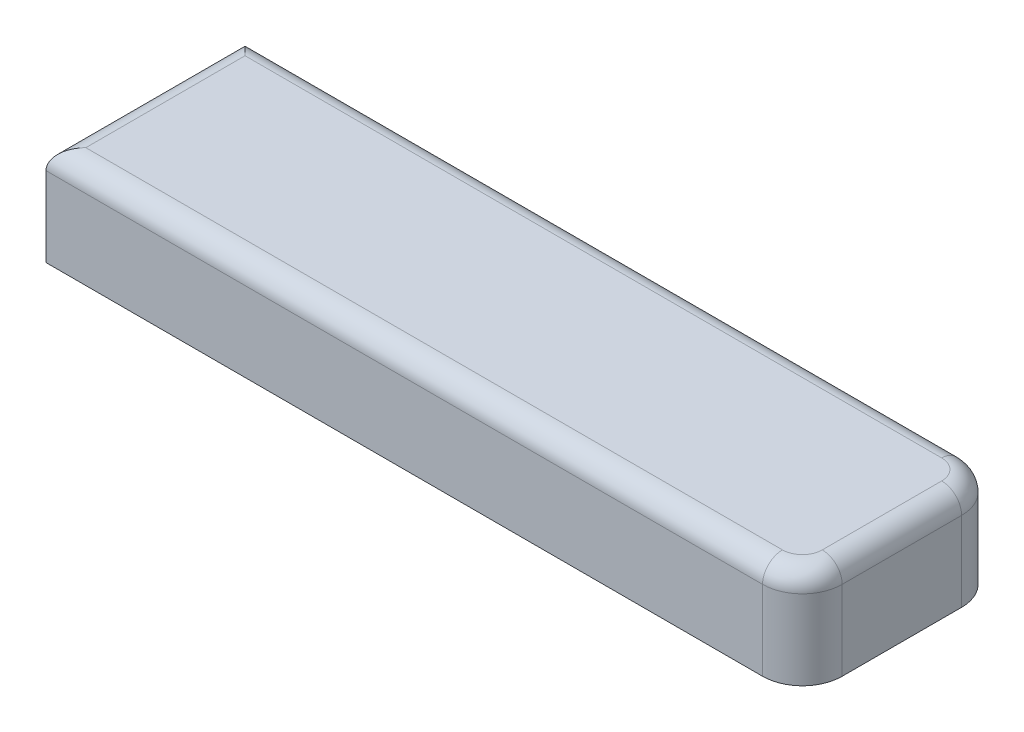
ISO-10303-21;
HEADER;
FILE_DESCRIPTION(('STEP AP214'),'2;1');
FILE_NAME('part.step','',(''),(''),'','','');
FILE_SCHEMA(('AUTOMOTIVE_DESIGN { 1 0 10303 214 1 1 1 1 }'));
ENDSEC;
DATA;
#1=APPLICATION_CONTEXT('core data for automotive mechanical design processes');
#2=APPLICATION_PROTOCOL_DEFINITION('international standard','automotive_design',2000,#1);
#3=PRODUCT_CONTEXT('',#1,'mechanical');
#4=PRODUCT('Part','Part','',(#3));
#5=PRODUCT_RELATED_PRODUCT_CATEGORY('part','',(#4));
#6=PRODUCT_DEFINITION_FORMATION('','',#4);
#7=PRODUCT_DEFINITION_CONTEXT('part definition',#1,'design');
#8=PRODUCT_DEFINITION('design','',#6,#7);
#9=PRODUCT_DEFINITION_SHAPE('','',#8);
#10=(LENGTH_UNIT() NAMED_UNIT(*) SI_UNIT(.MILLI.,.METRE.));
#11=(NAMED_UNIT(*) PLANE_ANGLE_UNIT() SI_UNIT($,.RADIAN.));
#12=(NAMED_UNIT(*) SI_UNIT($,.STERADIAN.) SOLID_ANGLE_UNIT());
#13=UNCERTAINTY_MEASURE_WITH_UNIT(LENGTH_MEASURE(1.E-05),#10,'distance_accuracy_value','');
#14=(GEOMETRIC_REPRESENTATION_CONTEXT(3) GLOBAL_UNCERTAINTY_ASSIGNED_CONTEXT((#13)) GLOBAL_UNIT_ASSIGNED_CONTEXT((#10,
#11,#12)) REPRESENTATION_CONTEXT('',''));
#15=CARTESIAN_POINT('',(0.,0.,0.));
#16=DIRECTION('',(0.,0.,1.));
#17=DIRECTION('',(1.,0.,0.));
#18=AXIS2_PLACEMENT_3D('',#15,#16,#17);
#19=CARTESIAN_POINT('',(0.,0.,10.));
#20=DIRECTION('',(0.,-1.,0.));
#21=DIRECTION('',(0.,0.,-1.));
#22=AXIS2_PLACEMENT_3D('',#19,#20,#21);
#23=PLANE('',#22);
#24=CARTESIAN_POINT('',(36.,0.,8.));
#25=DIRECTION('',(0.,-1.,0.));
#26=DIRECTION('',(0.,0.,-1.));
#27=AXIS2_PLACEMENT_3D('',#24,#25,#26);
#28=CIRCLE('',#27,1.);
#29=CARTESIAN_POINT('',(37.,0.,8.));
#30=VERTEX_POINT('',#29);
#31=CARTESIAN_POINT('',(36.,0.,9.));
#32=VERTEX_POINT('',#31);
#33=EDGE_CURVE('E169',#30,#32,#28,.T.);
#34=ORIENTED_EDGE('',*,*,#33,.F.);
#35=DIRECTION('',(0.,0.,-1.));
#36=VECTOR('',#35,1.);
#37=CARTESIAN_POINT('',(37.,0.,10.));
#38=LINE('',#37,#36);
#39=CARTESIAN_POINT('',(37.,0.,2.));
#40=VERTEX_POINT('',#39);
#41=EDGE_CURVE('E145',#30,#40,#38,.T.);
#42=ORIENTED_EDGE('',*,*,#41,.T.);
#43=CARTESIAN_POINT('',(36.,0.,2.));
#44=DIRECTION('',(0.,-1.,0.));
#45=DIRECTION('',(0.,0.,-1.));
#46=AXIS2_PLACEMENT_3D('',#43,#44,#45);
#47=CIRCLE('',#46,1.);
#48=CARTESIAN_POINT('',(36.,0.,0.999999999999999));
#49=VERTEX_POINT('',#48);
#50=EDGE_CURVE('E166',#49,#40,#47,.T.);
#51=ORIENTED_EDGE('',*,*,#50,.F.);
#52=DIRECTION('',(-1.,0.,0.));
#53=VECTOR('',#52,1.);
#54=CARTESIAN_POINT('',(0.,0.,0.999999999999999));
#55=LINE('',#54,#53);
#56=CARTESIAN_POINT('',(1.,0.,0.999999999999999));
#57=VERTEX_POINT('',#56);
#58=EDGE_CURVE('E133',#49,#57,#55,.T.);
#59=ORIENTED_EDGE('',*,*,#58,.T.);
#60=DIRECTION('',(0.,0.,-1.));
#61=VECTOR('',#60,1.);
#62=CARTESIAN_POINT('',(1.,0.,10.));
#63=LINE('',#62,#61);
#64=CARTESIAN_POINT('',(1.,0.,9.));
#65=VERTEX_POINT('',#64);
#66=EDGE_CURVE('E135',#57,#65,#63,.F.);
#67=ORIENTED_EDGE('',*,*,#66,.T.);
#68=DIRECTION('',(-1.,0.,0.));
#69=VECTOR('',#68,1.);
#70=CARTESIAN_POINT('',(38.,0.,9.));
#71=LINE('',#70,#69);
#72=EDGE_CURVE('E142',#65,#32,#71,.F.);
#73=ORIENTED_EDGE('',*,*,#72,.T.);
#74=EDGE_LOOP('',(#34,#42,#51,#59,#67,#73));
#75=FACE_BOUND('',#74,.T.);
#76=ADVANCED_FACE('F39',(#75),#23,.F.);
#77=CARTESIAN_POINT('',(0.,0.,10.));
#78=DIRECTION('',(1.,0.,0.));
#79=DIRECTION('',(0.,1.,0.));
#80=AXIS2_PLACEMENT_3D('',#77,#78,#79);
#81=PLANE('',#80);
#82=DIRECTION('',(0.,-1.,0.));
#83=VECTOR('',#82,1.);
#84=CARTESIAN_POINT('',(0.,0.,10.));
#85=LINE('',#84,#83);
#86=CARTESIAN_POINT('',(0.,-1.,10.));
#87=VERTEX_POINT('',#86);
#88=CARTESIAN_POINT('',(0.,-5.,10.));
#89=VERTEX_POINT('',#88);
#90=EDGE_CURVE('E114',#87,#89,#85,.T.);
#91=ORIENTED_EDGE('',*,*,#90,.F.);
#92=DIRECTION('',(0.,0.,-1.));
#93=VECTOR('',#92,1.);
#94=CARTESIAN_POINT('',(0.,-1.,10.));
#95=LINE('',#94,#93);
#96=CARTESIAN_POINT('',(0.,-1.,0.));
#97=VERTEX_POINT('',#96);
#98=EDGE_CURVE('E152',#87,#97,#95,.T.);
#99=ORIENTED_EDGE('',*,*,#98,.T.);
#100=DIRECTION('',(0.,-1.,0.));
#101=VECTOR('',#100,1.);
#102=CARTESIAN_POINT('',(0.,0.,0.));
#103=LINE('',#102,#101);
#104=CARTESIAN_POINT('',(0.,-5.,0.));
#105=VERTEX_POINT('',#104);
#106=EDGE_CURVE('E132',#97,#105,#103,.T.);
#107=ORIENTED_EDGE('',*,*,#106,.T.);
#108=DIRECTION('',(0.,0.,-1.));
#109=VECTOR('',#108,1.);
#110=CARTESIAN_POINT('',(0.,-5.,10.));
#111=LINE('',#110,#109);
#112=EDGE_CURVE('E127',#89,#105,#111,.T.);
#113=ORIENTED_EDGE('',*,*,#112,.F.);
#114=EDGE_LOOP('',(#91,#99,#107,#113));
#115=FACE_BOUND('',#114,.T.);
#116=ADVANCED_FACE('F130',(#115),#81,.F.);
#117=CARTESIAN_POINT('',(0.,-5.,10.));
#118=DIRECTION('',(0.,1.,0.));
#119=DIRECTION('',(-1.,0.,0.));
#120=AXIS2_PLACEMENT_3D('',#117,#118,#119);
#121=PLANE('',#120);
#122=DIRECTION('',(1.,0.,0.));
#123=VECTOR('',#122,1.);
#124=CARTESIAN_POINT('',(0.,-5.,0.));
#125=LINE('',#124,#123);
#126=CARTESIAN_POINT('',(36.,-5.,0.));
#127=VERTEX_POINT('',#126);
#128=EDGE_CURVE('E123',#105,#127,#125,.T.);
#129=ORIENTED_EDGE('',*,*,#128,.T.);
#130=CARTESIAN_POINT('',(36.,-5.,2.));
#131=DIRECTION('',(0.,1.,0.));
#132=DIRECTION('',(-1.,0.,0.));
#133=AXIS2_PLACEMENT_3D('',#130,#131,#132);
#134=CIRCLE('',#133,2.);
#135=CARTESIAN_POINT('',(38.,-5.,2.));
#136=VERTEX_POINT('',#135);
#137=EDGE_CURVE('E48',#127,#136,#134,.F.);
#138=ORIENTED_EDGE('',*,*,#137,.T.);
#139=DIRECTION('',(0.,0.,-1.));
#140=VECTOR('',#139,1.);
#141=CARTESIAN_POINT('',(38.,-5.,10.));
#142=LINE('',#141,#140);
#143=CARTESIAN_POINT('',(38.,-5.,8.));
#144=VERTEX_POINT('',#143);
#145=EDGE_CURVE('E128',#144,#136,#142,.T.);
#146=ORIENTED_EDGE('',*,*,#145,.F.);
#147=CARTESIAN_POINT('',(36.,-5.,8.));
#148=DIRECTION('',(0.,1.,0.));
#149=DIRECTION('',(-1.,0.,0.));
#150=AXIS2_PLACEMENT_3D('',#147,#148,#149);
#151=CIRCLE('',#150,2.);
#152=CARTESIAN_POINT('',(36.,-5.,10.));
#153=VERTEX_POINT('',#152);
#154=EDGE_CURVE('E56',#144,#153,#151,.F.);
#155=ORIENTED_EDGE('',*,*,#154,.T.);
#156=DIRECTION('',(1.,0.,0.));
#157=VECTOR('',#156,1.);
#158=CARTESIAN_POINT('',(0.,-5.,10.));
#159=LINE('',#158,#157);
#160=EDGE_CURVE('E116',#89,#153,#159,.T.);
#161=ORIENTED_EDGE('',*,*,#160,.F.);
#162=ORIENTED_EDGE('',*,*,#112,.T.);
#163=EDGE_LOOP('',(#129,#138,#146,#155,#161,#162));
#164=FACE_BOUND('',#163,.T.);
#165=ADVANCED_FACE('F126',(#164),#121,.F.);
#166=CARTESIAN_POINT('',(38.,0.,10.));
#167=DIRECTION('',(-1.,0.,0.));
#168=DIRECTION('',(0.,0.,1.));
#169=AXIS2_PLACEMENT_3D('',#166,#167,#168);
#170=PLANE('',#169);
#171=ORIENTED_EDGE('',*,*,#145,.T.);
#172=DIRECTION('',(0.,1.,0.));
#173=VECTOR('',#172,1.);
#174=CARTESIAN_POINT('',(38.,0.,2.));
#175=LINE('',#174,#173);
#176=CARTESIAN_POINT('',(38.,-1.,2.));
#177=VERTEX_POINT('',#176);
#178=EDGE_CURVE('E179',#136,#177,#175,.T.);
#179=ORIENTED_EDGE('',*,*,#178,.T.);
#180=DIRECTION('',(0.,0.,-1.));
#181=VECTOR('',#180,1.);
#182=CARTESIAN_POINT('',(38.,-1.,10.));
#183=LINE('',#182,#181);
#184=CARTESIAN_POINT('',(38.,-1.,8.));
#185=VERTEX_POINT('',#184);
#186=EDGE_CURVE('E148',#177,#185,#183,.F.);
#187=ORIENTED_EDGE('',*,*,#186,.T.);
#188=DIRECTION('',(0.,1.,0.));
#189=VECTOR('',#188,1.);
#190=CARTESIAN_POINT('',(38.,-5.,8.));
#191=LINE('',#190,#189);
#192=EDGE_CURVE('E177',#185,#144,#191,.F.);
#193=ORIENTED_EDGE('',*,*,#192,.T.);
#194=EDGE_LOOP('',(#171,#179,#187,#193));
#195=FACE_BOUND('',#194,.T.);
#196=ADVANCED_FACE('F198',(#195),#170,.F.);
#197=CARTESIAN_POINT('',(0.,0.,10.));
#198=DIRECTION('',(0.,0.,1.));
#199=DIRECTION('',(1.,0.,0.));
#200=AXIS2_PLACEMENT_3D('',#197,#198,#199);
#201=PLANE('',#200);
#202=ORIENTED_EDGE('',*,*,#160,.T.);
#203=DIRECTION('',(0.,1.,0.));
#204=VECTOR('',#203,1.);
#205=CARTESIAN_POINT('',(36.,-1.,10.));
#206=LINE('',#205,#204);
#207=CARTESIAN_POINT('',(36.,-1.,10.));
#208=VERTEX_POINT('',#207);
#209=EDGE_CURVE('E11',#153,#208,#206,.T.);
#210=ORIENTED_EDGE('',*,*,#209,.T.);
#211=DIRECTION('',(-1.,0.,0.));
#212=VECTOR('',#211,1.);
#213=CARTESIAN_POINT('',(0.,-1.,10.));
#214=LINE('',#213,#212);
#215=EDGE_CURVE('E119',#208,#87,#214,.T.);
#216=ORIENTED_EDGE('',*,*,#215,.T.);
#217=ORIENTED_EDGE('',*,*,#90,.T.);
#218=EDGE_LOOP('',(#202,#210,#216,#217));
#219=FACE_BOUND('',#218,.T.);
#220=ADVANCED_FACE('F115',(#219),#201,.T.);
#221=CARTESIAN_POINT('',(0.,0.,0.));
#222=DIRECTION('',(0.,0.,1.));
#223=DIRECTION('',(1.,0.,0.));
#224=AXIS2_PLACEMENT_3D('',#221,#222,#223);
#225=PLANE('',#224);
#226=DIRECTION('',(-1.,0.,0.));
#227=VECTOR('',#226,1.);
#228=CARTESIAN_POINT('',(0.,-1.,0.));
#229=LINE('',#228,#227);
#230=CARTESIAN_POINT('',(36.,-1.,0.));
#231=VERTEX_POINT('',#230);
#232=EDGE_CURVE('E154',#97,#231,#229,.F.);
#233=ORIENTED_EDGE('',*,*,#232,.T.);
#234=DIRECTION('',(0.,1.,0.));
#235=VECTOR('',#234,1.);
#236=CARTESIAN_POINT('',(36.,0.,0.));
#237=LINE('',#236,#235);
#238=EDGE_CURVE('E64',#231,#127,#237,.F.);
#239=ORIENTED_EDGE('',*,*,#238,.T.);
#240=ORIENTED_EDGE('',*,*,#128,.F.);
#241=ORIENTED_EDGE('',*,*,#106,.F.);
#242=EDGE_LOOP('',(#233,#239,#240,#241));
#243=FACE_BOUND('',#242,.T.);
#244=ADVANCED_FACE('F212',(#243),#225,.F.);
#245=CARTESIAN_POINT('',(1.,-1.,10.));
#246=DIRECTION('',(0.,0.,-1.));
#247=DIRECTION('',(-1.,0.,0.));
#248=AXIS2_PLACEMENT_3D('',#245,#246,#247);
#249=CYLINDRICAL_SURFACE('',#248,1.);
#250=CARTESIAN_POINT('',(1.,-1.,0.999999999999999));
#251=DIRECTION('',(-0.707106781186547,0.,0.707106781186547));
#252=DIRECTION('',(-0.707106781186547,0.,-0.707106781186547));
#253=AXIS2_PLACEMENT_3D('',#250,#251,#252);
#254=ELLIPSE('',#253,1.41421356237309,1.);
#255=EDGE_CURVE('E157',#97,#57,#254,.F.);
#256=ORIENTED_EDGE('',*,*,#255,.F.);
#257=ORIENTED_EDGE('',*,*,#98,.F.);
#258=CARTESIAN_POINT('',(1.,-1.,9.));
#259=DIRECTION('',(-0.707106781186547,0.,-0.707106781186547));
#260=DIRECTION('',(0.707106781186547,0.,-0.707106781186547));
#261=AXIS2_PLACEMENT_3D('',#258,#259,#260);
#262=ELLIPSE('',#261,1.41421356237309,1.);
#263=EDGE_CURVE('E160',#65,#87,#262,.F.);
#264=ORIENTED_EDGE('',*,*,#263,.F.);
#265=ORIENTED_EDGE('',*,*,#66,.F.);
#266=EDGE_LOOP('',(#256,#257,#264,#265));
#267=FACE_BOUND('',#266,.T.);
#268=ADVANCED_FACE('F210',(#267),#249,.T.);
#269=CARTESIAN_POINT('',(0.,-1.,9.));
#270=DIRECTION('',(1.,0.,0.));
#271=DIRECTION('',(0.,0.,-1.));
#272=AXIS2_PLACEMENT_3D('',#269,#270,#271);
#273=CYLINDRICAL_SURFACE('',#272,1.);
#274=ORIENTED_EDGE('',*,*,#215,.F.);
#275=CARTESIAN_POINT('',(36.,-1.,9.));
#276=DIRECTION('',(-1.,0.,0.));
#277=DIRECTION('',(0.,0.,1.));
#278=AXIS2_PLACEMENT_3D('',#275,#276,#277);
#279=CIRCLE('',#278,1.);
#280=EDGE_CURVE('E156',#208,#32,#279,.T.);
#281=ORIENTED_EDGE('',*,*,#280,.T.);
#282=ORIENTED_EDGE('',*,*,#72,.F.);
#283=ORIENTED_EDGE('',*,*,#263,.T.);
#284=EDGE_LOOP('',(#274,#281,#282,#283));
#285=FACE_BOUND('',#284,.T.);
#286=ADVANCED_FACE('F204',(#285),#273,.T.);
#287=CARTESIAN_POINT('',(0.,-1.,0.999999999999999));
#288=DIRECTION('',(-1.,0.,0.));
#289=DIRECTION('',(0.,0.,1.));
#290=AXIS2_PLACEMENT_3D('',#287,#288,#289);
#291=CYLINDRICAL_SURFACE('',#290,1.);
#292=ORIENTED_EDGE('',*,*,#58,.F.);
#293=CARTESIAN_POINT('',(36.,-1.,0.999999999999999));
#294=DIRECTION('',(-1.,0.,0.));
#295=DIRECTION('',(0.,0.,1.));
#296=AXIS2_PLACEMENT_3D('',#293,#294,#295);
#297=CIRCLE('',#296,1.);
#298=EDGE_CURVE('E175',#49,#231,#297,.T.);
#299=ORIENTED_EDGE('',*,*,#298,.T.);
#300=ORIENTED_EDGE('',*,*,#232,.F.);
#301=ORIENTED_EDGE('',*,*,#255,.T.);
#302=EDGE_LOOP('',(#292,#299,#300,#301));
#303=FACE_BOUND('',#302,.T.);
#304=ADVANCED_FACE('F216',(#303),#291,.T.);
#305=CARTESIAN_POINT('',(37.,-1.,10.));
#306=DIRECTION('',(0.,0.,-1.));
#307=DIRECTION('',(-1.,0.,0.));
#308=AXIS2_PLACEMENT_3D('',#305,#306,#307);
#309=CYLINDRICAL_SURFACE('',#308,1.);
#310=ORIENTED_EDGE('',*,*,#186,.F.);
#311=CARTESIAN_POINT('',(37.,-1.,2.));
#312=DIRECTION('',(0.,0.,1.));
#313=DIRECTION('',(1.,0.,0.));
#314=AXIS2_PLACEMENT_3D('',#311,#312,#313);
#315=CIRCLE('',#314,1.);
#316=EDGE_CURVE('E173',#177,#40,#315,.T.);
#317=ORIENTED_EDGE('',*,*,#316,.T.);
#318=ORIENTED_EDGE('',*,*,#41,.F.);
#319=CARTESIAN_POINT('',(37.,-1.,8.));
#320=DIRECTION('',(0.,0.,-1.));
#321=DIRECTION('',(-1.,0.,0.));
#322=AXIS2_PLACEMENT_3D('',#319,#320,#321);
#323=CIRCLE('',#322,1.);
#324=EDGE_CURVE('E171',#30,#185,#323,.T.);
#325=ORIENTED_EDGE('',*,*,#324,.T.);
#326=EDGE_LOOP('',(#310,#317,#318,#325));
#327=FACE_BOUND('',#326,.T.);
#328=ADVANCED_FACE('F220',(#327),#309,.T.);
#329=CARTESIAN_POINT('',(36.,0.,8.));
#330=DIRECTION('',(0.,-1.,0.));
#331=DIRECTION('',(0.,0.,-1.));
#332=AXIS2_PLACEMENT_3D('',#329,#330,#331);
#333=CYLINDRICAL_SURFACE('',#332,2.);
#334=ORIENTED_EDGE('',*,*,#154,.F.);
#335=ORIENTED_EDGE('',*,*,#192,.F.);
#336=CARTESIAN_POINT('',(36.,-1.,8.));
#337=DIRECTION('',(0.,-1.,0.));
#338=DIRECTION('',(0.,0.,-1.));
#339=AXIS2_PLACEMENT_3D('',#336,#337,#338);
#340=CIRCLE('',#339,2.);
#341=EDGE_CURVE('E161',#208,#185,#340,.F.);
#342=ORIENTED_EDGE('',*,*,#341,.F.);
#343=ORIENTED_EDGE('',*,*,#209,.F.);
#344=EDGE_LOOP('',(#334,#335,#342,#343));
#345=FACE_BOUND('',#344,.T.);
#346=ADVANCED_FACE('F202',(#345),#333,.T.);
#347=CARTESIAN_POINT('',(36.,-1.,8.));
#348=DIRECTION('',(0.,-1.,0.));
#349=DIRECTION('',(0.,0.,-1.));
#350=AXIS2_PLACEMENT_3D('',#347,#348,#349);
#351=DEGENERATE_TOROIDAL_SURFACE('',#350,1.,1.,.T.);
#352=ORIENTED_EDGE('',*,*,#280,.F.);
#353=ORIENTED_EDGE('',*,*,#341,.T.);
#354=ORIENTED_EDGE('',*,*,#324,.F.);
#355=ORIENTED_EDGE('',*,*,#33,.T.);
#356=EDGE_LOOP('',(#352,#353,#354,#355));
#357=FACE_BOUND('',#356,.T.);
#358=ADVANCED_FACE('F221',(#357),#351,.T.);
#359=CARTESIAN_POINT('',(36.,0.,2.));
#360=DIRECTION('',(0.,1.,0.));
#361=DIRECTION('',(0.,0.,1.));
#362=AXIS2_PLACEMENT_3D('',#359,#360,#361);
#363=CYLINDRICAL_SURFACE('',#362,2.);
#364=ORIENTED_EDGE('',*,*,#137,.F.);
#365=ORIENTED_EDGE('',*,*,#238,.F.);
#366=CARTESIAN_POINT('',(36.,-1.,2.));
#367=DIRECTION('',(0.,-1.,0.));
#368=DIRECTION('',(0.,0.,-1.));
#369=AXIS2_PLACEMENT_3D('',#366,#367,#368);
#370=CIRCLE('',#369,2.);
#371=EDGE_CURVE('E43',#177,#231,#370,.F.);
#372=ORIENTED_EDGE('',*,*,#371,.F.);
#373=ORIENTED_EDGE('',*,*,#178,.F.);
#374=EDGE_LOOP('',(#364,#365,#372,#373));
#375=FACE_BOUND('',#374,.T.);
#376=ADVANCED_FACE('F41',(#375),#363,.T.);
#377=CARTESIAN_POINT('',(36.,-1.,2.));
#378=DIRECTION('',(0.,-1.,0.));
#379=DIRECTION('',(0.,0.,-1.));
#380=AXIS2_PLACEMENT_3D('',#377,#378,#379);
#381=DEGENERATE_TOROIDAL_SURFACE('',#380,1.,1.,.T.);
#382=ORIENTED_EDGE('',*,*,#298,.F.);
#383=ORIENTED_EDGE('',*,*,#50,.T.);
#384=ORIENTED_EDGE('',*,*,#316,.F.);
#385=ORIENTED_EDGE('',*,*,#371,.T.);
#386=EDGE_LOOP('',(#382,#383,#384,#385));
#387=FACE_BOUND('',#386,.T.);
#388=ADVANCED_FACE('F192',(#387),#381,.T.);
#389=CLOSED_SHELL('',(#76,#116,#165,#196,#220,#244,#268,#286,#304,#328,#346,#358,#376,#388));
#390=MANIFOLD_SOLID_BREP('B2',#389);
#391=ADVANCED_BREP_SHAPE_REPRESENTATION('',(#18,#390),#14);
#392=SHAPE_DEFINITION_REPRESENTATION(#9,#391);
ENDSEC;
END-ISO-10303-21;
